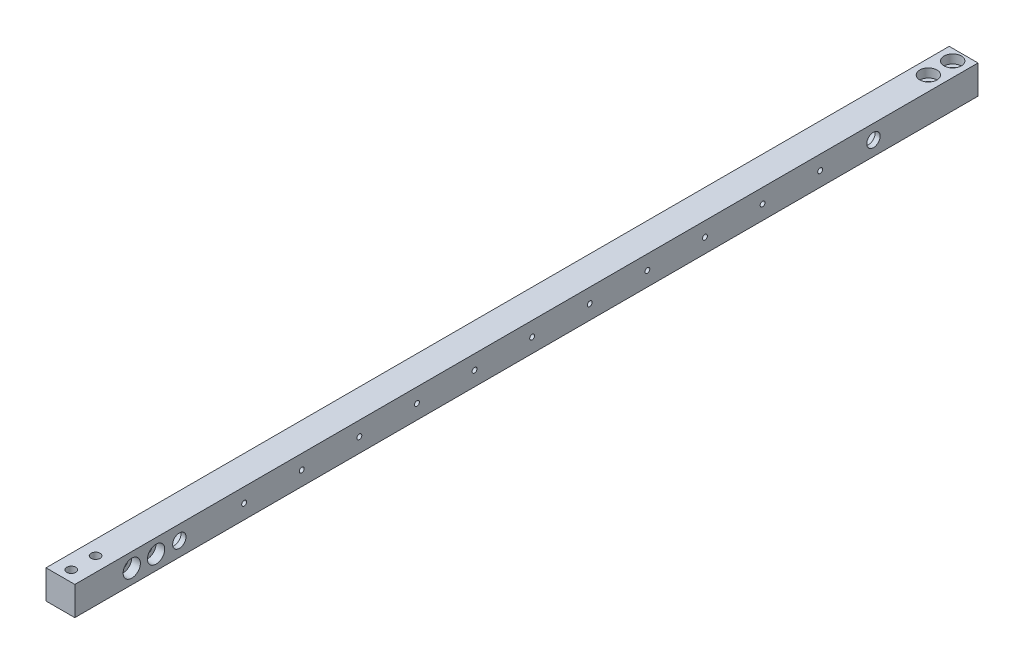
ISO-10303-21;
HEADER;
FILE_DESCRIPTION(('STEP AP214'),'2;1');
FILE_NAME('part.step','',(''),(''),'','','');
FILE_SCHEMA(('AUTOMOTIVE_DESIGN { 1 0 10303 214 1 1 1 1 }'));
ENDSEC;
DATA;
#1=APPLICATION_CONTEXT('core data for automotive mechanical design processes');
#2=APPLICATION_PROTOCOL_DEFINITION('international standard','automotive_design',2000,#1);
#3=PRODUCT_CONTEXT('',#1,'mechanical');
#4=PRODUCT('Part','Part','',(#3));
#5=PRODUCT_RELATED_PRODUCT_CATEGORY('part','',(#4));
#6=PRODUCT_DEFINITION_FORMATION('','',#4);
#7=PRODUCT_DEFINITION_CONTEXT('part definition',#1,'design');
#8=PRODUCT_DEFINITION('design','',#6,#7);
#9=PRODUCT_DEFINITION_SHAPE('','',#8);
#10=(LENGTH_UNIT() NAMED_UNIT(*) SI_UNIT(.MILLI.,.METRE.));
#11=(NAMED_UNIT(*) PLANE_ANGLE_UNIT() SI_UNIT($,.RADIAN.));
#12=(NAMED_UNIT(*) SI_UNIT($,.STERADIAN.) SOLID_ANGLE_UNIT());
#13=UNCERTAINTY_MEASURE_WITH_UNIT(LENGTH_MEASURE(1.E-05),#10,'distance_accuracy_value','');
#14=(GEOMETRIC_REPRESENTATION_CONTEXT(3) GLOBAL_UNCERTAINTY_ASSIGNED_CONTEXT((#13)) GLOBAL_UNIT_ASSIGNED_CONTEXT((#10,
#11,#12)) REPRESENTATION_CONTEXT('',''));
#15=CARTESIAN_POINT('',(0.,0.,0.));
#16=DIRECTION('',(0.,0.,1.));
#17=DIRECTION('',(1.,0.,0.));
#18=AXIS2_PLACEMENT_3D('',#15,#16,#17);
#19=CARTESIAN_POINT('',(0.,0.,497.84));
#20=DIRECTION('',(1.,0.,0.));
#21=DIRECTION('',(0.,1.,0.));
#22=AXIS2_PLACEMENT_3D('',#19,#20,#21);
#23=PLANE('',#22);
#24=CARTESIAN_POINT('',(0.,7.93749999999971,453.040000000001));
#25=DIRECTION('',(1.,0.,0.));
#26=DIRECTION('',(0.,1.,0.));
#27=AXIS2_PLACEMENT_3D('',#24,#25,#26);
#28=CIRCLE('',#27,2.4892);
#29=CARTESIAN_POINT('',(0.,10.4266999999997,453.040000000001));
#30=VERTEX_POINT('',#29);
#31=EDGE_CURVE('E40',#30,#30,#28,.T.);
#32=ORIENTED_EDGE('',*,*,#31,.T.);
#33=EDGE_LOOP('',(#32));
#34=FACE_BOUND('',#33,.T.);
#35=CARTESIAN_POINT('',(0.,7.93749999999971,466.44));
#36=DIRECTION('',(1.,0.,0.));
#37=DIRECTION('',(0.,1.,0.));
#38=AXIS2_PLACEMENT_3D('',#35,#36,#37);
#39=CIRCLE('',#38,2.4892);
#40=CARTESIAN_POINT('',(0.,10.4266999999997,466.44));
#41=VERTEX_POINT('',#40);
#42=EDGE_CURVE('E145',#41,#41,#39,.T.);
#43=ORIENTED_EDGE('',*,*,#42,.T.);
#44=EDGE_LOOP('',(#43));
#45=FACE_BOUND('',#44,.T.);
#46=CARTESIAN_POINT('',(0.,7.93749999999993,404.495));
#47=DIRECTION('',(1.,0.,0.));
#48=DIRECTION('',(0.,1.,0.));
#49=AXIS2_PLACEMENT_3D('',#46,#47,#48);
#50=CIRCLE('',#49,1.35254999999994);
#51=CARTESIAN_POINT('',(0.,9.29004999999987,404.495));
#52=VERTEX_POINT('',#51);
#53=EDGE_CURVE('E191',#52,#52,#50,.T.);
#54=ORIENTED_EDGE('',*,*,#53,.T.);
#55=EDGE_LOOP('',(#54));
#56=FACE_BOUND('',#55,.T.);
#57=CARTESIAN_POINT('',(0.,7.93749999999993,372.745));
#58=DIRECTION('',(1.,0.,0.));
#59=DIRECTION('',(0.,1.,0.));
#60=AXIS2_PLACEMENT_3D('',#57,#58,#59);
#61=CIRCLE('',#60,1.35254999999994);
#62=CARTESIAN_POINT('',(0.,9.29004999999987,372.745));
#63=VERTEX_POINT('',#62);
#64=EDGE_CURVE('E197',#63,#63,#61,.T.);
#65=ORIENTED_EDGE('',*,*,#64,.T.);
#66=EDGE_LOOP('',(#65));
#67=FACE_BOUND('',#66,.T.);
#68=CARTESIAN_POINT('',(0.,7.93749999999993,340.995));
#69=DIRECTION('',(1.,0.,0.));
#70=DIRECTION('',(0.,1.,0.));
#71=AXIS2_PLACEMENT_3D('',#68,#69,#70);
#72=CIRCLE('',#71,1.35254999999994);
#73=CARTESIAN_POINT('',(0.,9.29004999999987,340.995));
#74=VERTEX_POINT('',#73);
#75=EDGE_CURVE('E203',#74,#74,#72,.T.);
#76=ORIENTED_EDGE('',*,*,#75,.T.);
#77=EDGE_LOOP('',(#76));
#78=FACE_BOUND('',#77,.T.);
#79=CARTESIAN_POINT('',(0.,7.93749999999993,309.245));
#80=DIRECTION('',(1.,0.,0.));
#81=DIRECTION('',(0.,1.,0.));
#82=AXIS2_PLACEMENT_3D('',#79,#80,#81);
#83=CIRCLE('',#82,1.35254999999994);
#84=CARTESIAN_POINT('',(0.,9.29004999999987,309.245));
#85=VERTEX_POINT('',#84);
#86=EDGE_CURVE('E209',#85,#85,#83,.T.);
#87=ORIENTED_EDGE('',*,*,#86,.T.);
#88=EDGE_LOOP('',(#87));
#89=FACE_BOUND('',#88,.T.);
#90=CARTESIAN_POINT('',(0.,7.93749999999993,277.495));
#91=DIRECTION('',(1.,0.,0.));
#92=DIRECTION('',(0.,1.,0.));
#93=AXIS2_PLACEMENT_3D('',#90,#91,#92);
#94=CIRCLE('',#93,1.35254999999994);
#95=CARTESIAN_POINT('',(0.,9.29004999999987,277.495));
#96=VERTEX_POINT('',#95);
#97=EDGE_CURVE('E215',#96,#96,#94,.T.);
#98=ORIENTED_EDGE('',*,*,#97,.T.);
#99=EDGE_LOOP('',(#98));
#100=FACE_BOUND('',#99,.T.);
#101=CARTESIAN_POINT('',(0.,7.93749999999993,245.745));
#102=DIRECTION('',(1.,0.,0.));
#103=DIRECTION('',(0.,1.,0.));
#104=AXIS2_PLACEMENT_3D('',#101,#102,#103);
#105=CIRCLE('',#104,1.35254999999994);
#106=CARTESIAN_POINT('',(0.,9.29004999999987,245.745));
#107=VERTEX_POINT('',#106);
#108=EDGE_CURVE('E221',#107,#107,#105,.T.);
#109=ORIENTED_EDGE('',*,*,#108,.T.);
#110=EDGE_LOOP('',(#109));
#111=FACE_BOUND('',#110,.T.);
#112=CARTESIAN_POINT('',(0.,7.93749999999993,213.995));
#113=DIRECTION('',(1.,0.,0.));
#114=DIRECTION('',(0.,1.,0.));
#115=AXIS2_PLACEMENT_3D('',#112,#113,#114);
#116=CIRCLE('',#115,1.35254999999994);
#117=CARTESIAN_POINT('',(0.,9.29004999999987,213.995));
#118=VERTEX_POINT('',#117);
#119=EDGE_CURVE('E227',#118,#118,#116,.T.);
#120=ORIENTED_EDGE('',*,*,#119,.T.);
#121=EDGE_LOOP('',(#120));
#122=FACE_BOUND('',#121,.T.);
#123=CARTESIAN_POINT('',(0.,7.93749999999993,182.245));
#124=DIRECTION('',(1.,0.,0.));
#125=DIRECTION('',(0.,1.,0.));
#126=AXIS2_PLACEMENT_3D('',#123,#124,#125);
#127=CIRCLE('',#126,1.35254999999994);
#128=CARTESIAN_POINT('',(0.,9.29004999999987,182.245));
#129=VERTEX_POINT('',#128);
#130=EDGE_CURVE('E121',#129,#129,#127,.T.);
#131=ORIENTED_EDGE('',*,*,#130,.T.);
#132=EDGE_LOOP('',(#131));
#133=FACE_BOUND('',#132,.T.);
#134=CARTESIAN_POINT('',(0.,7.93749999999993,150.495));
#135=DIRECTION('',(1.,0.,0.));
#136=DIRECTION('',(0.,1.,0.));
#137=AXIS2_PLACEMENT_3D('',#134,#135,#136);
#138=CIRCLE('',#137,1.35254999999994);
#139=CARTESIAN_POINT('',(0.,9.29004999999987,150.495));
#140=VERTEX_POINT('',#139);
#141=EDGE_CURVE('E234',#140,#140,#138,.T.);
#142=ORIENTED_EDGE('',*,*,#141,.T.);
#143=EDGE_LOOP('',(#142));
#144=FACE_BOUND('',#143,.T.);
#145=CARTESIAN_POINT('',(0.,7.93749999999993,118.745));
#146=DIRECTION('',(1.,0.,0.));
#147=DIRECTION('',(0.,1.,0.));
#148=AXIS2_PLACEMENT_3D('',#145,#146,#147);
#149=CIRCLE('',#148,1.35254999999994);
#150=CARTESIAN_POINT('',(0.,9.29004999999987,118.745));
#151=VERTEX_POINT('',#150);
#152=EDGE_CURVE('E240',#151,#151,#149,.T.);
#153=ORIENTED_EDGE('',*,*,#152,.T.);
#154=EDGE_LOOP('',(#153));
#155=FACE_BOUND('',#154,.T.);
#156=CARTESIAN_POINT('',(0.,7.93749999999993,86.9950000000001));
#157=DIRECTION('',(1.,0.,0.));
#158=DIRECTION('',(0.,1.,0.));
#159=AXIS2_PLACEMENT_3D('',#156,#157,#158);
#160=CIRCLE('',#159,1.35254999999994);
#161=CARTESIAN_POINT('',(0.,9.29004999999987,86.9950000000001));
#162=VERTEX_POINT('',#161);
#163=EDGE_CURVE('E246',#162,#162,#160,.T.);
#164=ORIENTED_EDGE('',*,*,#163,.T.);
#165=EDGE_LOOP('',(#164));
#166=FACE_BOUND('',#165,.T.);
#167=CARTESIAN_POINT('',(0.,7.93749999999997,57.6199));
#168=DIRECTION('',(-1.,0.,0.));
#169=DIRECTION('',(0.,1.,0.));
#170=AXIS2_PLACEMENT_3D('',#167,#168,#169);
#171=CIRCLE('',#170,6.81989999999999);
#172=CARTESIAN_POINT('',(0.,14.7574,57.6199));
#173=VERTEX_POINT('',#172);
#174=EDGE_CURVE('E115',#173,#173,#171,.T.);
#175=ORIENTED_EDGE('',*,*,#174,.F.);
#176=EDGE_LOOP('',(#175));
#177=FACE_BOUND('',#176,.T.);
#178=CARTESIAN_POINT('',(0.,7.93749999999999,440.2201));
#179=DIRECTION('',(-1.,0.,0.));
#180=DIRECTION('',(0.,-1.,0.));
#181=AXIS2_PLACEMENT_3D('',#178,#179,#180);
#182=CIRCLE('',#181,6.81989999999997);
#183=CARTESIAN_POINT('',(0.,1.11760000000003,440.2201));
#184=VERTEX_POINT('',#183);
#185=EDGE_CURVE('E256',#184,#184,#182,.T.);
#186=ORIENTED_EDGE('',*,*,#185,.F.);
#187=EDGE_LOOP('',(#186));
#188=FACE_BOUND('',#187,.T.);
#189=DIRECTION('',(0.,-1.,0.));
#190=VECTOR('',#189,1.);
#191=CARTESIAN_POINT('',(0.,0.,0.));
#192=LINE('',#191,#190);
#193=CARTESIAN_POINT('',(0.,15.875,0.));
#194=VERTEX_POINT('',#193);
#195=CARTESIAN_POINT('',(0.,0.,0.));
#196=VERTEX_POINT('',#195);
#197=EDGE_CURVE('E103',#194,#196,#192,.T.);
#198=ORIENTED_EDGE('',*,*,#197,.T.);
#199=DIRECTION('',(0.,0.,-1.));
#200=VECTOR('',#199,1.);
#201=CARTESIAN_POINT('',(0.,0.,497.84));
#202=LINE('',#201,#200);
#203=CARTESIAN_POINT('',(0.,0.,497.84));
#204=VERTEX_POINT('',#203);
#205=EDGE_CURVE('E11',#204,#196,#202,.T.);
#206=ORIENTED_EDGE('',*,*,#205,.F.);
#207=DIRECTION('',(0.,-1.,0.));
#208=VECTOR('',#207,1.);
#209=CARTESIAN_POINT('',(0.,0.,497.84));
#210=LINE('',#209,#208);
#211=CARTESIAN_POINT('',(0.,15.875,497.84));
#212=VERTEX_POINT('',#211);
#213=EDGE_CURVE('E90',#212,#204,#210,.T.);
#214=ORIENTED_EDGE('',*,*,#213,.F.);
#215=DIRECTION('',(0.,0.,-1.));
#216=VECTOR('',#215,1.);
#217=CARTESIAN_POINT('',(0.,15.875,497.84));
#218=LINE('',#217,#216);
#219=EDGE_CURVE('E99',#212,#194,#218,.T.);
#220=ORIENTED_EDGE('',*,*,#219,.T.);
#221=EDGE_LOOP('',(#198,#206,#214,#220));
#222=FACE_BOUND('',#221,.T.);
#223=ADVANCED_FACE('F37',(#34,#45,#56,#67,#78,#89,#100,#111,#122,#133,#144,#155,#166,#177,#188,
#222),#23,.F.);
#224=CARTESIAN_POINT('',(0.,0.,497.84));
#225=DIRECTION('',(0.,1.,0.));
#226=DIRECTION('',(0.,0.,1.));
#227=AXIS2_PLACEMENT_3D('',#224,#225,#226);
#228=PLANE('',#227);
#229=CARTESIAN_POINT('',(7.93750000000043,0.,19.4000000000003));
#230=DIRECTION('',(0.,1.,0.));
#231=DIRECTION('',(0.,0.,1.));
#232=AXIS2_PLACEMENT_3D('',#229,#230,#231);
#233=CIRCLE('',#232,2.4892);
#234=CARTESIAN_POINT('',(7.93750000000043,0.,21.8892000000003));
#235=VERTEX_POINT('',#234);
#236=EDGE_CURVE('E141',#235,#235,#233,.T.);
#237=ORIENTED_EDGE('',*,*,#236,.T.);
#238=EDGE_LOOP('',(#237));
#239=FACE_BOUND('',#238,.T.);
#240=CARTESIAN_POINT('',(7.93750000000043,0.,6.00000000000023));
#241=DIRECTION('',(0.,1.,0.));
#242=DIRECTION('',(0.,0.,1.));
#243=AXIS2_PLACEMENT_3D('',#240,#241,#242);
#244=CIRCLE('',#243,2.4892);
#245=CARTESIAN_POINT('',(7.93750000000043,0.,8.48920000000022));
#246=VERTEX_POINT('',#245);
#247=EDGE_CURVE('E136',#246,#246,#244,.T.);
#248=ORIENTED_EDGE('',*,*,#247,.T.);
#249=EDGE_LOOP('',(#248));
#250=FACE_BOUND('',#249,.T.);
#251=CARTESIAN_POINT('',(7.93750000000015,2.14273828715028E-13,478.44));
#252=DIRECTION('',(0.,-1.,0.));
#253=DIRECTION('',(0.,0.,-1.));
#254=AXIS2_PLACEMENT_3D('',#251,#252,#253);
#255=CIRCLE('',#254,4.7625);
#256=CARTESIAN_POINT('',(7.93750000000015,2.14273828715028E-13,473.6775));
#257=VERTEX_POINT('',#256);
#258=EDGE_CURVE('E139',#257,#257,#255,.T.);
#259=ORIENTED_EDGE('',*,*,#258,.F.);
#260=EDGE_LOOP('',(#259));
#261=FACE_BOUND('',#260,.T.);
#262=CARTESIAN_POINT('',(7.93750000000026,2.20224624127019E-13,491.84));
#263=DIRECTION('',(0.,-1.,0.));
#264=DIRECTION('',(0.,0.,-1.));
#265=AXIS2_PLACEMENT_3D('',#262,#263,#264);
#266=CIRCLE('',#265,4.7625);
#267=CARTESIAN_POINT('',(7.93750000000026,2.20224624127019E-13,487.0775));
#268=VERTEX_POINT('',#267);
#269=EDGE_CURVE('E134',#268,#268,#266,.T.);
#270=ORIENTED_EDGE('',*,*,#269,.F.);
#271=EDGE_LOOP('',(#270));
#272=FACE_BOUND('',#271,.T.);
#273=DIRECTION('',(1.,0.,0.));
#274=VECTOR('',#273,1.);
#275=CARTESIAN_POINT('',(0.,0.,0.));
#276=LINE('',#275,#274);
#277=CARTESIAN_POINT('',(15.875,0.,0.));
#278=VERTEX_POINT('',#277);
#279=EDGE_CURVE('E94',#196,#278,#276,.T.);
#280=ORIENTED_EDGE('',*,*,#279,.T.);
#281=DIRECTION('',(0.,0.,-1.));
#282=VECTOR('',#281,1.);
#283=CARTESIAN_POINT('',(15.875,0.,497.84));
#284=LINE('',#283,#282);
#285=CARTESIAN_POINT('',(15.875,0.,497.84));
#286=VERTEX_POINT('',#285);
#287=EDGE_CURVE('E46',#286,#278,#284,.T.);
#288=ORIENTED_EDGE('',*,*,#287,.F.);
#289=DIRECTION('',(1.,0.,0.));
#290=VECTOR('',#289,1.);
#291=CARTESIAN_POINT('',(0.,0.,497.84));
#292=LINE('',#291,#290);
#293=EDGE_CURVE('E85',#204,#286,#292,.T.);
#294=ORIENTED_EDGE('',*,*,#293,.F.);
#295=ORIENTED_EDGE('',*,*,#205,.T.);
#296=EDGE_LOOP('',(#280,#288,#294,#295));
#297=FACE_BOUND('',#296,.T.);
#298=ADVANCED_FACE('F93',(#239,#250,#261,#272,#297),#228,.F.);
#299=CARTESIAN_POINT('',(15.875,0.,497.84));
#300=DIRECTION('',(-1.,0.,0.));
#301=DIRECTION('',(0.,-1.,0.));
#302=AXIS2_PLACEMENT_3D('',#299,#300,#301);
#303=PLANE('',#302);
#304=CARTESIAN_POINT('',(15.875,7.93749999999971,453.040000000001));
#305=DIRECTION('',(1.,0.,0.));
#306=DIRECTION('',(0.,0.,-1.));
#307=AXIS2_PLACEMENT_3D('',#304,#305,#306);
#308=CIRCLE('',#307,4.7625);
#309=CARTESIAN_POINT('',(15.875,7.93749999999971,448.277500000001));
#310=VERTEX_POINT('',#309);
#311=EDGE_CURVE('E643',#310,#310,#308,.T.);
#312=ORIENTED_EDGE('',*,*,#311,.F.);
#313=EDGE_LOOP('',(#312));
#314=FACE_BOUND('',#313,.T.);
#315=CARTESIAN_POINT('',(15.875,7.93749999999971,466.44));
#316=DIRECTION('',(1.,0.,0.));
#317=DIRECTION('',(0.,0.,-1.));
#318=AXIS2_PLACEMENT_3D('',#315,#316,#317);
#319=CIRCLE('',#318,4.7625);
#320=CARTESIAN_POINT('',(15.875,7.93749999999971,461.6775));
#321=VERTEX_POINT('',#320);
#322=EDGE_CURVE('E160',#321,#321,#319,.T.);
#323=ORIENTED_EDGE('',*,*,#322,.F.);
#324=EDGE_LOOP('',(#323));
#325=FACE_BOUND('',#324,.T.);
#326=CARTESIAN_POINT('',(15.8750000000001,7.93749999999993,404.495));
#327=DIRECTION('',(-1.,0.,0.));
#328=DIRECTION('',(0.,0.,1.));
#329=AXIS2_PLACEMENT_3D('',#326,#327,#328);
#330=CIRCLE('',#329,1.35254999999988);
#331=CARTESIAN_POINT('',(15.8750000000001,7.93749999999993,405.84755));
#332=VERTEX_POINT('',#331);
#333=EDGE_CURVE('E129',#332,#332,#330,.T.);
#334=ORIENTED_EDGE('',*,*,#333,.T.);
#335=EDGE_LOOP('',(#334));
#336=FACE_BOUND('',#335,.T.);
#337=CARTESIAN_POINT('',(15.8750000000001,7.93749999999993,372.745));
#338=DIRECTION('',(-1.,0.,0.));
#339=DIRECTION('',(0.,0.,1.));
#340=AXIS2_PLACEMENT_3D('',#337,#338,#339);
#341=CIRCLE('',#340,1.35254999999988);
#342=CARTESIAN_POINT('',(15.8750000000001,7.93749999999993,374.09755));
#343=VERTEX_POINT('',#342);
#344=EDGE_CURVE('E194',#343,#343,#341,.T.);
#345=ORIENTED_EDGE('',*,*,#344,.T.);
#346=EDGE_LOOP('',(#345));
#347=FACE_BOUND('',#346,.T.);
#348=CARTESIAN_POINT('',(15.875,7.93749999999993,340.995));
#349=DIRECTION('',(-1.,0.,0.));
#350=DIRECTION('',(0.,0.,1.));
#351=AXIS2_PLACEMENT_3D('',#348,#349,#350);
#352=CIRCLE('',#351,1.35254999999988);
#353=CARTESIAN_POINT('',(15.875,7.93749999999993,342.34755));
#354=VERTEX_POINT('',#353);
#355=EDGE_CURVE('E200',#354,#354,#352,.T.);
#356=ORIENTED_EDGE('',*,*,#355,.T.);
#357=EDGE_LOOP('',(#356));
#358=FACE_BOUND('',#357,.T.);
#359=CARTESIAN_POINT('',(15.875,7.93749999999993,309.245));
#360=DIRECTION('',(-1.,0.,0.));
#361=DIRECTION('',(0.,0.,1.));
#362=AXIS2_PLACEMENT_3D('',#359,#360,#361);
#363=CIRCLE('',#362,1.35254999999988);
#364=CARTESIAN_POINT('',(15.875,7.93749999999993,310.59755));
#365=VERTEX_POINT('',#364);
#366=EDGE_CURVE('E206',#365,#365,#363,.T.);
#367=ORIENTED_EDGE('',*,*,#366,.T.);
#368=EDGE_LOOP('',(#367));
#369=FACE_BOUND('',#368,.T.);
#370=CARTESIAN_POINT('',(15.875,7.93749999999993,277.495));
#371=DIRECTION('',(-1.,0.,0.));
#372=DIRECTION('',(0.,0.,1.));
#373=AXIS2_PLACEMENT_3D('',#370,#371,#372);
#374=CIRCLE('',#373,1.35254999999988);
#375=CARTESIAN_POINT('',(15.875,7.93749999999993,278.84755));
#376=VERTEX_POINT('',#375);
#377=EDGE_CURVE('E212',#376,#376,#374,.T.);
#378=ORIENTED_EDGE('',*,*,#377,.T.);
#379=EDGE_LOOP('',(#378));
#380=FACE_BOUND('',#379,.T.);
#381=CARTESIAN_POINT('',(15.875,7.93749999999993,245.745));
#382=DIRECTION('',(-1.,0.,0.));
#383=DIRECTION('',(0.,0.,1.));
#384=AXIS2_PLACEMENT_3D('',#381,#382,#383);
#385=CIRCLE('',#384,1.35254999999988);
#386=CARTESIAN_POINT('',(15.875,7.93749999999993,247.09755));
#387=VERTEX_POINT('',#386);
#388=EDGE_CURVE('E218',#387,#387,#385,.T.);
#389=ORIENTED_EDGE('',*,*,#388,.T.);
#390=EDGE_LOOP('',(#389));
#391=FACE_BOUND('',#390,.T.);
#392=CARTESIAN_POINT('',(15.875,7.93749999999993,213.995));
#393=DIRECTION('',(-1.,0.,0.));
#394=DIRECTION('',(0.,0.,1.));
#395=AXIS2_PLACEMENT_3D('',#392,#393,#394);
#396=CIRCLE('',#395,1.35254999999988);
#397=CARTESIAN_POINT('',(15.875,7.93749999999993,215.34755));
#398=VERTEX_POINT('',#397);
#399=EDGE_CURVE('E224',#398,#398,#396,.T.);
#400=ORIENTED_EDGE('',*,*,#399,.T.);
#401=EDGE_LOOP('',(#400));
#402=FACE_BOUND('',#401,.T.);
#403=CARTESIAN_POINT('',(15.875,7.93749999999993,182.245));
#404=DIRECTION('',(-1.,0.,0.));
#405=DIRECTION('',(0.,0.,1.));
#406=AXIS2_PLACEMENT_3D('',#403,#404,#405);
#407=CIRCLE('',#406,1.35254999999988);
#408=CARTESIAN_POINT('',(15.875,7.93749999999993,183.59755));
#409=VERTEX_POINT('',#408);
#410=EDGE_CURVE('E125',#409,#409,#407,.T.);
#411=ORIENTED_EDGE('',*,*,#410,.T.);
#412=EDGE_LOOP('',(#411));
#413=FACE_BOUND('',#412,.T.);
#414=CARTESIAN_POINT('',(15.875,7.93749999999993,150.495));
#415=DIRECTION('',(-1.,0.,0.));
#416=DIRECTION('',(0.,0.,1.));
#417=AXIS2_PLACEMENT_3D('',#414,#415,#416);
#418=CIRCLE('',#417,1.35254999999988);
#419=CARTESIAN_POINT('',(15.875,7.93749999999993,151.84755));
#420=VERTEX_POINT('',#419);
#421=EDGE_CURVE('E124',#420,#420,#418,.T.);
#422=ORIENTED_EDGE('',*,*,#421,.T.);
#423=EDGE_LOOP('',(#422));
#424=FACE_BOUND('',#423,.T.);
#425=CARTESIAN_POINT('',(15.875,7.93749999999993,118.745));
#426=DIRECTION('',(-1.,0.,0.));
#427=DIRECTION('',(0.,0.,1.));
#428=AXIS2_PLACEMENT_3D('',#425,#426,#427);
#429=CIRCLE('',#428,1.35254999999988);
#430=CARTESIAN_POINT('',(15.875,7.93749999999993,120.09755));
#431=VERTEX_POINT('',#430);
#432=EDGE_CURVE('E237',#431,#431,#429,.T.);
#433=ORIENTED_EDGE('',*,*,#432,.T.);
#434=EDGE_LOOP('',(#433));
#435=FACE_BOUND('',#434,.T.);
#436=CARTESIAN_POINT('',(15.875,7.93749999999993,86.9950000000001));
#437=DIRECTION('',(-1.,0.,0.));
#438=DIRECTION('',(0.,0.,1.));
#439=AXIS2_PLACEMENT_3D('',#436,#437,#438);
#440=CIRCLE('',#439,1.35254999999988);
#441=CARTESIAN_POINT('',(15.875,7.93749999999993,88.34755));
#442=VERTEX_POINT('',#441);
#443=EDGE_CURVE('E243',#442,#442,#440,.T.);
#444=ORIENTED_EDGE('',*,*,#443,.T.);
#445=EDGE_LOOP('',(#444));
#446=FACE_BOUND('',#445,.T.);
#447=CARTESIAN_POINT('',(15.875,7.93749999999997,57.6199));
#448=DIRECTION('',(-1.,0.,0.));
#449=DIRECTION('',(0.,-1.,0.));
#450=AXIS2_PLACEMENT_3D('',#447,#448,#449);
#451=CIRCLE('',#450,3.68299999999999);
#452=CARTESIAN_POINT('',(15.875,4.25449999999998,57.6199));
#453=VERTEX_POINT('',#452);
#454=EDGE_CURVE('E117',#453,#453,#451,.T.);
#455=ORIENTED_EDGE('',*,*,#454,.T.);
#456=EDGE_LOOP('',(#455));
#457=FACE_BOUND('',#456,.T.);
#458=CARTESIAN_POINT('',(15.875,7.93749999999999,440.2201));
#459=DIRECTION('',(-1.,0.,0.));
#460=DIRECTION('',(0.,-1.,0.));
#461=AXIS2_PLACEMENT_3D('',#458,#459,#460);
#462=CIRCLE('',#461,3.68299999999999);
#463=CARTESIAN_POINT('',(15.875,4.2545,440.2201));
#464=VERTEX_POINT('',#463);
#465=EDGE_CURVE('E112',#464,#464,#462,.T.);
#466=ORIENTED_EDGE('',*,*,#465,.T.);
#467=EDGE_LOOP('',(#466));
#468=FACE_BOUND('',#467,.T.);
#469=DIRECTION('',(0.,1.,0.));
#470=VECTOR('',#469,1.);
#471=CARTESIAN_POINT('',(15.875,0.,0.));
#472=LINE('',#471,#470);
#473=CARTESIAN_POINT('',(15.875,15.875,0.));
#474=VERTEX_POINT('',#473);
#475=EDGE_CURVE('E72',#278,#474,#472,.T.);
#476=ORIENTED_EDGE('',*,*,#475,.T.);
#477=DIRECTION('',(0.,0.,-1.));
#478=VECTOR('',#477,1.);
#479=CARTESIAN_POINT('',(15.875,15.875,497.84));
#480=LINE('',#479,#478);
#481=CARTESIAN_POINT('',(15.875,15.875,497.84));
#482=VERTEX_POINT('',#481);
#483=EDGE_CURVE('E95',#482,#474,#480,.T.);
#484=ORIENTED_EDGE('',*,*,#483,.F.);
#485=DIRECTION('',(0.,1.,0.));
#486=VECTOR('',#485,1.);
#487=CARTESIAN_POINT('',(15.875,0.,497.84));
#488=LINE('',#487,#486);
#489=EDGE_CURVE('E88',#286,#482,#488,.T.);
#490=ORIENTED_EDGE('',*,*,#489,.F.);
#491=ORIENTED_EDGE('',*,*,#287,.T.);
#492=EDGE_LOOP('',(#476,#484,#490,#491));
#493=FACE_BOUND('',#492,.T.);
#494=ADVANCED_FACE('F97',(#314,#325,#336,#347,#358,#369,#380,#391,#402,#413,#424,#435,#446,#457,
#468,#493),#303,.F.);
#495=CARTESIAN_POINT('',(0.,15.875,497.84));
#496=DIRECTION('',(0.,-1.,0.));
#497=DIRECTION('',(0.,0.,-1.));
#498=AXIS2_PLACEMENT_3D('',#495,#496,#497);
#499=PLANE('',#498);
#500=CARTESIAN_POINT('',(7.93750000000043,15.8750000000001,19.4000000000003));
#501=DIRECTION('',(0.,1.,0.));
#502=DIRECTION('',(0.,0.,1.));
#503=AXIS2_PLACEMENT_3D('',#500,#501,#502);
#504=CIRCLE('',#503,4.7625);
#505=CARTESIAN_POINT('',(7.93750000000043,15.8750000000001,24.1625000000003));
#506=VERTEX_POINT('',#505);
#507=EDGE_CURVE('E147',#506,#506,#504,.T.);
#508=ORIENTED_EDGE('',*,*,#507,.F.);
#509=EDGE_LOOP('',(#508));
#510=FACE_BOUND('',#509,.T.);
#511=CARTESIAN_POINT('',(7.93750000000043,15.8750000000001,6.00000000000023));
#512=DIRECTION('',(0.,1.,0.));
#513=DIRECTION('',(0.,0.,1.));
#514=AXIS2_PLACEMENT_3D('',#511,#512,#513);
#515=CIRCLE('',#514,4.7625);
#516=CARTESIAN_POINT('',(7.93750000000043,15.8750000000001,10.7625000000002));
#517=VERTEX_POINT('',#516);
#518=EDGE_CURVE('E143',#517,#517,#515,.T.);
#519=ORIENTED_EDGE('',*,*,#518,.F.);
#520=EDGE_LOOP('',(#519));
#521=FACE_BOUND('',#520,.T.);
#522=CARTESIAN_POINT('',(7.93750000000015,15.875,478.44));
#523=DIRECTION('',(0.,-1.,0.));
#524=DIRECTION('',(0.,0.,-1.));
#525=AXIS2_PLACEMENT_3D('',#522,#523,#524);
#526=CIRCLE('',#525,2.4892);
#527=CARTESIAN_POINT('',(7.93750000000015,15.875,475.9508));
#528=VERTEX_POINT('',#527);
#529=EDGE_CURVE('E131',#528,#528,#526,.T.);
#530=ORIENTED_EDGE('',*,*,#529,.T.);
#531=EDGE_LOOP('',(#530));
#532=FACE_BOUND('',#531,.T.);
#533=CARTESIAN_POINT('',(7.93750000000026,15.875,491.84));
#534=DIRECTION('',(0.,-1.,0.));
#535=DIRECTION('',(0.,0.,-1.));
#536=AXIS2_PLACEMENT_3D('',#533,#534,#535);
#537=CIRCLE('',#536,2.4892);
#538=CARTESIAN_POINT('',(7.93750000000026,15.875,489.350800000001));
#539=VERTEX_POINT('',#538);
#540=EDGE_CURVE('E126',#539,#539,#537,.T.);
#541=ORIENTED_EDGE('',*,*,#540,.T.);
#542=EDGE_LOOP('',(#541));
#543=FACE_BOUND('',#542,.T.);
#544=DIRECTION('',(-1.,0.,0.));
#545=VECTOR('',#544,1.);
#546=CARTESIAN_POINT('',(0.,15.875,0.));
#547=LINE('',#546,#545);
#548=EDGE_CURVE('E78',#474,#194,#547,.T.);
#549=ORIENTED_EDGE('',*,*,#548,.T.);
#550=ORIENTED_EDGE('',*,*,#219,.F.);
#551=DIRECTION('',(-1.,0.,0.));
#552=VECTOR('',#551,1.);
#553=CARTESIAN_POINT('',(0.,15.875,497.84));
#554=LINE('',#553,#552);
#555=EDGE_CURVE('E55',#482,#212,#554,.T.);
#556=ORIENTED_EDGE('',*,*,#555,.F.);
#557=ORIENTED_EDGE('',*,*,#483,.T.);
#558=EDGE_LOOP('',(#549,#550,#556,#557));
#559=FACE_BOUND('',#558,.T.);
#560=ADVANCED_FACE('F281',(#510,#521,#532,#543,#559),#499,.F.);
#561=CARTESIAN_POINT('',(0.,0.,497.84));
#562=DIRECTION('',(0.,0.,-1.));
#563=DIRECTION('',(-1.,0.,0.));
#564=AXIS2_PLACEMENT_3D('',#561,#562,#563);
#565=PLANE('',#564);
#566=ORIENTED_EDGE('',*,*,#213,.T.);
#567=ORIENTED_EDGE('',*,*,#293,.T.);
#568=ORIENTED_EDGE('',*,*,#489,.T.);
#569=ORIENTED_EDGE('',*,*,#555,.T.);
#570=EDGE_LOOP('',(#566,#567,#568,#569));
#571=FACE_BOUND('',#570,.T.);
#572=ADVANCED_FACE('F86',(#571),#565,.F.);
#573=CARTESIAN_POINT('',(0.,0.,0.));
#574=DIRECTION('',(0.,0.,-1.));
#575=DIRECTION('',(-1.,0.,0.));
#576=AXIS2_PLACEMENT_3D('',#573,#574,#575);
#577=PLANE('',#576);
#578=ORIENTED_EDGE('',*,*,#197,.F.);
#579=ORIENTED_EDGE('',*,*,#548,.F.);
#580=ORIENTED_EDGE('',*,*,#475,.F.);
#581=ORIENTED_EDGE('',*,*,#279,.F.);
#582=EDGE_LOOP('',(#578,#579,#580,#581));
#583=FACE_BOUND('',#582,.T.);
#584=ADVANCED_FACE('F271',(#583),#577,.T.);
#585=CARTESIAN_POINT('',(13.08608,7.93749999999999,440.2201));
#586=DIRECTION('',(-1.,0.,0.));
#587=DIRECTION('',(0.,-1.,0.));
#588=AXIS2_PLACEMENT_3D('',#585,#586,#587);
#589=CYLINDRICAL_SURFACE('',#588,6.81989999999997);
#590=CARTESIAN_POINT('',(13.08608,7.93749999999999,440.2201));
#591=DIRECTION('',(-1.,0.,0.));
#592=DIRECTION('',(0.,-1.,0.));
#593=AXIS2_PLACEMENT_3D('',#590,#591,#592);
#594=CIRCLE('',#593,6.81989999999997);
#595=CARTESIAN_POINT('',(13.08608,1.11760000000003,440.2201));
#596=VERTEX_POINT('',#595);
#597=EDGE_CURVE('E106',#596,#596,#594,.T.);
#598=ORIENTED_EDGE('',*,*,#597,.F.);
#599=EDGE_LOOP('',(#598));
#600=FACE_BOUND('',#599,.T.);
#601=ORIENTED_EDGE('',*,*,#185,.T.);
#602=EDGE_LOOP('',(#601));
#603=FACE_BOUND('',#602,.T.);
#604=ADVANCED_FACE('F264',(#600,#603),#589,.F.);
#605=CARTESIAN_POINT('',(13.08608,7.93749999999999,440.2201));
#606=DIRECTION('',(-1.,0.,0.));
#607=DIRECTION('',(0.,-1.,0.));
#608=AXIS2_PLACEMENT_3D('',#605,#606,#607);
#609=PLANE('',#608);
#610=CARTESIAN_POINT('',(13.08608,7.93749999999999,440.2201));
#611=DIRECTION('',(-1.,0.,0.));
#612=DIRECTION('',(0.,0.,1.));
#613=AXIS2_PLACEMENT_3D('',#610,#611,#612);
#614=CIRCLE('',#613,3.68299999999999);
#615=CARTESIAN_POINT('',(13.08608,7.93749999999999,443.9031));
#616=VERTEX_POINT('',#615);
#617=EDGE_CURVE('E116',#616,#616,#614,.T.);
#618=ORIENTED_EDGE('',*,*,#617,.F.);
#619=EDGE_LOOP('',(#618));
#620=FACE_BOUND('',#619,.T.);
#621=ORIENTED_EDGE('',*,*,#597,.T.);
#622=EDGE_LOOP('',(#621));
#623=FACE_BOUND('',#622,.T.);
#624=ADVANCED_FACE('F278',(#620,#623),#609,.T.);
#625=CARTESIAN_POINT('',(13.08608,7.93749999999997,57.6199));
#626=DIRECTION('',(-1.,0.,0.));
#627=DIRECTION('',(0.,-1.,0.));
#628=AXIS2_PLACEMENT_3D('',#625,#626,#627);
#629=CYLINDRICAL_SURFACE('',#628,6.81989999999999);
#630=CARTESIAN_POINT('',(13.08608,7.93749999999997,57.6199));
#631=DIRECTION('',(-1.,0.,0.));
#632=DIRECTION('',(0.,1.,0.));
#633=AXIS2_PLACEMENT_3D('',#630,#631,#632);
#634=CIRCLE('',#633,6.81989999999999);
#635=CARTESIAN_POINT('',(13.08608,14.7574,57.6199));
#636=VERTEX_POINT('',#635);
#637=EDGE_CURVE('E253',#636,#636,#634,.T.);
#638=ORIENTED_EDGE('',*,*,#637,.F.);
#639=EDGE_LOOP('',(#638));
#640=FACE_BOUND('',#639,.T.);
#641=ORIENTED_EDGE('',*,*,#174,.T.);
#642=EDGE_LOOP('',(#641));
#643=FACE_BOUND('',#642,.T.);
#644=ADVANCED_FACE('F378',(#640,#643),#629,.F.);
#645=CARTESIAN_POINT('',(13.08608,7.93749999999997,57.6199));
#646=DIRECTION('',(1.,0.,0.));
#647=DIRECTION('',(0.,1.,0.));
#648=AXIS2_PLACEMENT_3D('',#645,#646,#647);
#649=PLANE('',#648);
#650=CARTESIAN_POINT('',(13.08608,7.93749999999997,57.6199));
#651=DIRECTION('',(-1.,0.,0.));
#652=DIRECTION('',(0.,0.,1.));
#653=AXIS2_PLACEMENT_3D('',#650,#651,#652);
#654=CIRCLE('',#653,3.68299999999999);
#655=CARTESIAN_POINT('',(13.08608,7.93749999999997,61.3029));
#656=VERTEX_POINT('',#655);
#657=EDGE_CURVE('E120',#656,#656,#654,.T.);
#658=ORIENTED_EDGE('',*,*,#657,.F.);
#659=EDGE_LOOP('',(#658));
#660=FACE_BOUND('',#659,.T.);
#661=ORIENTED_EDGE('',*,*,#637,.T.);
#662=EDGE_LOOP('',(#661));
#663=FACE_BOUND('',#662,.T.);
#664=ADVANCED_FACE('F374',(#660,#663),#649,.F.);
#665=CARTESIAN_POINT('',(13.08608,7.93749999999999,440.2201));
#666=DIRECTION('',(-1.,0.,0.));
#667=DIRECTION('',(0.,0.,1.));
#668=AXIS2_PLACEMENT_3D('',#665,#666,#667);
#669=CYLINDRICAL_SURFACE('',#668,3.68299999999999);
#670=ORIENTED_EDGE('',*,*,#617,.T.);
#671=EDGE_LOOP('',(#670));
#672=FACE_BOUND('',#671,.T.);
#673=ORIENTED_EDGE('',*,*,#465,.F.);
#674=EDGE_LOOP('',(#673));
#675=FACE_BOUND('',#674,.T.);
#676=ADVANCED_FACE('F370',(#672,#675),#669,.F.);
#677=CARTESIAN_POINT('',(13.08608,7.93749999999997,57.6199));
#678=DIRECTION('',(-1.,0.,0.));
#679=DIRECTION('',(0.,0.,1.));
#680=AXIS2_PLACEMENT_3D('',#677,#678,#679);
#681=CYLINDRICAL_SURFACE('',#680,3.68299999999999);
#682=ORIENTED_EDGE('',*,*,#657,.T.);
#683=EDGE_LOOP('',(#682));
#684=FACE_BOUND('',#683,.T.);
#685=ORIENTED_EDGE('',*,*,#454,.F.);
#686=EDGE_LOOP('',(#685));
#687=FACE_BOUND('',#686,.T.);
#688=ADVANCED_FACE('F366',(#684,#687),#681,.F.);
#689=CARTESIAN_POINT('',(-468.3125,7.93749999999993,86.9950000000002));
#690=DIRECTION('',(-1.,0.,0.));
#691=DIRECTION('',(0.,0.,1.));
#692=AXIS2_PLACEMENT_3D('',#689,#690,#691);
#693=CYLINDRICAL_SURFACE('',#692,1.35254999999994);
#694=ORIENTED_EDGE('',*,*,#443,.F.);
#695=EDGE_LOOP('',(#694));
#696=FACE_BOUND('',#695,.T.);
#697=ORIENTED_EDGE('',*,*,#163,.F.);
#698=EDGE_LOOP('',(#697));
#699=FACE_BOUND('',#698,.T.);
#700=ADVANCED_FACE('F362',(#696,#699),#693,.F.);
#701=CARTESIAN_POINT('',(-468.3125,7.93749999999993,118.745));
#702=DIRECTION('',(-1.,0.,0.));
#703=DIRECTION('',(0.,0.,1.));
#704=AXIS2_PLACEMENT_3D('',#701,#702,#703);
#705=CYLINDRICAL_SURFACE('',#704,1.35254999999994);
#706=ORIENTED_EDGE('',*,*,#432,.F.);
#707=EDGE_LOOP('',(#706));
#708=FACE_BOUND('',#707,.T.);
#709=ORIENTED_EDGE('',*,*,#152,.F.);
#710=EDGE_LOOP('',(#709));
#711=FACE_BOUND('',#710,.T.);
#712=ADVANCED_FACE('F358',(#708,#711),#705,.F.);
#713=CARTESIAN_POINT('',(-468.3125,7.93749999999993,150.495));
#714=DIRECTION('',(-1.,0.,0.));
#715=DIRECTION('',(0.,0.,1.));
#716=AXIS2_PLACEMENT_3D('',#713,#714,#715);
#717=CYLINDRICAL_SURFACE('',#716,1.35254999999994);
#718=ORIENTED_EDGE('',*,*,#421,.F.);
#719=EDGE_LOOP('',(#718));
#720=FACE_BOUND('',#719,.T.);
#721=ORIENTED_EDGE('',*,*,#141,.F.);
#722=EDGE_LOOP('',(#721));
#723=FACE_BOUND('',#722,.T.);
#724=ADVANCED_FACE('F354',(#720,#723),#717,.F.);
#725=CARTESIAN_POINT('',(-468.3125,7.93749999999993,182.245));
#726=DIRECTION('',(-1.,0.,0.));
#727=DIRECTION('',(0.,0.,1.));
#728=AXIS2_PLACEMENT_3D('',#725,#726,#727);
#729=CYLINDRICAL_SURFACE('',#728,1.35254999999994);
#730=ORIENTED_EDGE('',*,*,#410,.F.);
#731=EDGE_LOOP('',(#730));
#732=FACE_BOUND('',#731,.T.);
#733=ORIENTED_EDGE('',*,*,#130,.F.);
#734=EDGE_LOOP('',(#733));
#735=FACE_BOUND('',#734,.T.);
#736=ADVANCED_FACE('F350',(#732,#735),#729,.F.);
#737=CARTESIAN_POINT('',(-468.3125,7.93749999999993,213.995));
#738=DIRECTION('',(-1.,0.,0.));
#739=DIRECTION('',(0.,0.,1.));
#740=AXIS2_PLACEMENT_3D('',#737,#738,#739);
#741=CYLINDRICAL_SURFACE('',#740,1.35254999999994);
#742=ORIENTED_EDGE('',*,*,#399,.F.);
#743=EDGE_LOOP('',(#742));
#744=FACE_BOUND('',#743,.T.);
#745=ORIENTED_EDGE('',*,*,#119,.F.);
#746=EDGE_LOOP('',(#745));
#747=FACE_BOUND('',#746,.T.);
#748=ADVANCED_FACE('F346',(#744,#747),#741,.F.);
#749=CARTESIAN_POINT('',(-468.3125,7.93749999999993,245.745));
#750=DIRECTION('',(-1.,0.,0.));
#751=DIRECTION('',(0.,0.,1.));
#752=AXIS2_PLACEMENT_3D('',#749,#750,#751);
#753=CYLINDRICAL_SURFACE('',#752,1.35254999999994);
#754=ORIENTED_EDGE('',*,*,#388,.F.);
#755=EDGE_LOOP('',(#754));
#756=FACE_BOUND('',#755,.T.);
#757=ORIENTED_EDGE('',*,*,#108,.F.);
#758=EDGE_LOOP('',(#757));
#759=FACE_BOUND('',#758,.T.);
#760=ADVANCED_FACE('F342',(#756,#759),#753,.F.);
#761=CARTESIAN_POINT('',(-468.3125,7.93749999999993,277.495));
#762=DIRECTION('',(-1.,0.,0.));
#763=DIRECTION('',(0.,0.,1.));
#764=AXIS2_PLACEMENT_3D('',#761,#762,#763);
#765=CYLINDRICAL_SURFACE('',#764,1.35254999999994);
#766=ORIENTED_EDGE('',*,*,#377,.F.);
#767=EDGE_LOOP('',(#766));
#768=FACE_BOUND('',#767,.T.);
#769=ORIENTED_EDGE('',*,*,#97,.F.);
#770=EDGE_LOOP('',(#769));
#771=FACE_BOUND('',#770,.T.);
#772=ADVANCED_FACE('F338',(#768,#771),#765,.F.);
#773=CARTESIAN_POINT('',(-468.3125,7.93749999999993,309.245));
#774=DIRECTION('',(-1.,0.,0.));
#775=DIRECTION('',(0.,0.,1.));
#776=AXIS2_PLACEMENT_3D('',#773,#774,#775);
#777=CYLINDRICAL_SURFACE('',#776,1.35254999999994);
#778=ORIENTED_EDGE('',*,*,#366,.F.);
#779=EDGE_LOOP('',(#778));
#780=FACE_BOUND('',#779,.T.);
#781=ORIENTED_EDGE('',*,*,#86,.F.);
#782=EDGE_LOOP('',(#781));
#783=FACE_BOUND('',#782,.T.);
#784=ADVANCED_FACE('F334',(#780,#783),#777,.F.);
#785=CARTESIAN_POINT('',(-468.3125,7.93749999999993,340.995));
#786=DIRECTION('',(-1.,0.,0.));
#787=DIRECTION('',(0.,0.,1.));
#788=AXIS2_PLACEMENT_3D('',#785,#786,#787);
#789=CYLINDRICAL_SURFACE('',#788,1.35254999999994);
#790=ORIENTED_EDGE('',*,*,#355,.F.);
#791=EDGE_LOOP('',(#790));
#792=FACE_BOUND('',#791,.T.);
#793=ORIENTED_EDGE('',*,*,#75,.F.);
#794=EDGE_LOOP('',(#793));
#795=FACE_BOUND('',#794,.T.);
#796=ADVANCED_FACE('F330',(#792,#795),#789,.F.);
#797=CARTESIAN_POINT('',(-468.3125,7.93749999999993,372.745));
#798=DIRECTION('',(-1.,0.,0.));
#799=DIRECTION('',(0.,0.,1.));
#800=AXIS2_PLACEMENT_3D('',#797,#798,#799);
#801=CYLINDRICAL_SURFACE('',#800,1.35254999999994);
#802=ORIENTED_EDGE('',*,*,#344,.F.);
#803=EDGE_LOOP('',(#802));
#804=FACE_BOUND('',#803,.T.);
#805=ORIENTED_EDGE('',*,*,#64,.F.);
#806=EDGE_LOOP('',(#805));
#807=FACE_BOUND('',#806,.T.);
#808=ADVANCED_FACE('F326',(#804,#807),#801,.F.);
#809=CARTESIAN_POINT('',(-468.3125,7.93749999999993,404.495));
#810=DIRECTION('',(-1.,0.,0.));
#811=DIRECTION('',(0.,0.,1.));
#812=AXIS2_PLACEMENT_3D('',#809,#810,#811);
#813=CYLINDRICAL_SURFACE('',#812,1.35254999999994);
#814=ORIENTED_EDGE('',*,*,#333,.F.);
#815=EDGE_LOOP('',(#814));
#816=FACE_BOUND('',#815,.T.);
#817=ORIENTED_EDGE('',*,*,#53,.F.);
#818=EDGE_LOOP('',(#817));
#819=FACE_BOUND('',#818,.T.);
#820=ADVANCED_FACE('F322',(#816,#819),#813,.F.);
#821=CARTESIAN_POINT('',(7.93750000000026,2.20224624127019E-13,491.84));
#822=DIRECTION('',(0.,-1.,0.));
#823=DIRECTION('',(0.,0.,-1.));
#824=AXIS2_PLACEMENT_3D('',#821,#822,#823);
#825=CYLINDRICAL_SURFACE('',#824,2.4892);
#826=CARTESIAN_POINT('',(7.93750000000026,4.82600000000022,491.84));
#827=DIRECTION('',(0.,-1.,0.));
#828=DIRECTION('',(0.,0.,-1.));
#829=AXIS2_PLACEMENT_3D('',#826,#827,#828);
#830=CIRCLE('',#829,2.4892);
#831=CARTESIAN_POINT('',(7.93750000000026,4.82600000000022,489.350800000001));
#832=VERTEX_POINT('',#831);
#833=EDGE_CURVE('E130',#832,#832,#830,.T.);
#834=ORIENTED_EDGE('',*,*,#833,.T.);
#835=EDGE_LOOP('',(#834));
#836=FACE_BOUND('',#835,.T.);
#837=ORIENTED_EDGE('',*,*,#540,.F.);
#838=EDGE_LOOP('',(#837));
#839=FACE_BOUND('',#838,.T.);
#840=ADVANCED_FACE('F314',(#836,#839),#825,.F.);
#841=CARTESIAN_POINT('',(10.4267000000003,4.82600000000022,491.84));
#842=DIRECTION('',(0.,1.,0.));
#843=DIRECTION('',(0.,0.,1.));
#844=AXIS2_PLACEMENT_3D('',#841,#842,#843);
#845=PLANE('',#844);
#846=ORIENTED_EDGE('',*,*,#833,.F.);
#847=EDGE_LOOP('',(#846));
#848=FACE_BOUND('',#847,.T.);
#849=CARTESIAN_POINT('',(7.93750000000026,4.82600000000022,491.84));
#850=DIRECTION('',(0.,-1.,0.));
#851=DIRECTION('',(0.,0.,-1.));
#852=AXIS2_PLACEMENT_3D('',#849,#850,#851);
#853=CIRCLE('',#852,4.7625);
#854=CARTESIAN_POINT('',(7.93750000000026,4.82600000000022,487.0775));
#855=VERTEX_POINT('',#854);
#856=EDGE_CURVE('E184',#855,#855,#853,.T.);
#857=ORIENTED_EDGE('',*,*,#856,.T.);
#858=EDGE_LOOP('',(#857));
#859=FACE_BOUND('',#858,.T.);
#860=ADVANCED_FACE('F304',(#848,#859),#845,.F.);
#861=CARTESIAN_POINT('',(7.93750000000026,2.20224624127019E-13,491.84));
#862=DIRECTION('',(0.,-1.,0.));
#863=DIRECTION('',(0.,0.,-1.));
#864=AXIS2_PLACEMENT_3D('',#861,#862,#863);
#865=CYLINDRICAL_SURFACE('',#864,4.7625);
#866=ORIENTED_EDGE('',*,*,#856,.F.);
#867=EDGE_LOOP('',(#866));
#868=FACE_BOUND('',#867,.T.);
#869=ORIENTED_EDGE('',*,*,#269,.T.);
#870=EDGE_LOOP('',(#869));
#871=FACE_BOUND('',#870,.T.);
#872=ADVANCED_FACE('F301',(#868,#871),#865,.F.);
#873=CARTESIAN_POINT('',(7.93750000000015,2.14273828715028E-13,478.44));
#874=DIRECTION('',(0.,-1.,0.));
#875=DIRECTION('',(0.,0.,-1.));
#876=AXIS2_PLACEMENT_3D('',#873,#874,#875);
#877=CYLINDRICAL_SURFACE('',#876,2.4892);
#878=CARTESIAN_POINT('',(7.93750000000015,4.82600000000021,478.44));
#879=DIRECTION('',(0.,-1.,0.));
#880=DIRECTION('',(0.,0.,-1.));
#881=AXIS2_PLACEMENT_3D('',#878,#879,#880);
#882=CIRCLE('',#881,2.4892);
#883=CARTESIAN_POINT('',(7.93750000000015,4.82600000000021,475.9508));
#884=VERTEX_POINT('',#883);
#885=EDGE_CURVE('E135',#884,#884,#882,.T.);
#886=ORIENTED_EDGE('',*,*,#885,.T.);
#887=EDGE_LOOP('',(#886));
#888=FACE_BOUND('',#887,.T.);
#889=ORIENTED_EDGE('',*,*,#529,.F.);
#890=EDGE_LOOP('',(#889));
#891=FACE_BOUND('',#890,.T.);
#892=ADVANCED_FACE('F303',(#888,#891),#877,.F.);
#893=CARTESIAN_POINT('',(10.4267000000001,4.82600000000021,478.44));
#894=DIRECTION('',(0.,1.,0.));
#895=DIRECTION('',(0.,0.,1.));
#896=AXIS2_PLACEMENT_3D('',#893,#894,#895);
#897=PLANE('',#896);
#898=ORIENTED_EDGE('',*,*,#885,.F.);
#899=EDGE_LOOP('',(#898));
#900=FACE_BOUND('',#899,.T.);
#901=CARTESIAN_POINT('',(7.93750000000015,4.82600000000021,478.44));
#902=DIRECTION('',(0.,-1.,0.));
#903=DIRECTION('',(0.,0.,-1.));
#904=AXIS2_PLACEMENT_3D('',#901,#902,#903);
#905=CIRCLE('',#904,4.7625);
#906=CARTESIAN_POINT('',(7.93750000000015,4.82600000000021,473.6775));
#907=VERTEX_POINT('',#906);
#908=EDGE_CURVE('E177',#907,#907,#905,.T.);
#909=ORIENTED_EDGE('',*,*,#908,.T.);
#910=EDGE_LOOP('',(#909));
#911=FACE_BOUND('',#910,.T.);
#912=ADVANCED_FACE('F311',(#900,#911),#897,.F.);
#913=CARTESIAN_POINT('',(7.93750000000015,2.14273828715028E-13,478.44));
#914=DIRECTION('',(0.,-1.,0.));
#915=DIRECTION('',(0.,0.,-1.));
#916=AXIS2_PLACEMENT_3D('',#913,#914,#915);
#917=CYLINDRICAL_SURFACE('',#916,4.7625);
#918=ORIENTED_EDGE('',*,*,#908,.F.);
#919=EDGE_LOOP('',(#918));
#920=FACE_BOUND('',#919,.T.);
#921=ORIENTED_EDGE('',*,*,#258,.T.);
#922=EDGE_LOOP('',(#921));
#923=FACE_BOUND('',#922,.T.);
#924=ADVANCED_FACE('F482',(#920,#923),#917,.F.);
#925=CARTESIAN_POINT('',(7.93750000000043,15.8750000000001,6.00000000000023));
#926=DIRECTION('',(0.,1.,0.));
#927=DIRECTION('',(0.,0.,1.));
#928=AXIS2_PLACEMENT_3D('',#925,#926,#927);
#929=CYLINDRICAL_SURFACE('',#928,2.4892);
#930=CARTESIAN_POINT('',(7.93750000000043,11.0490000000001,6.00000000000023));
#931=DIRECTION('',(0.,1.,0.));
#932=DIRECTION('',(0.,0.,1.));
#933=AXIS2_PLACEMENT_3D('',#930,#931,#932);
#934=CIRCLE('',#933,2.4892);
#935=CARTESIAN_POINT('',(7.93750000000043,11.0490000000001,8.48920000000022));
#936=VERTEX_POINT('',#935);
#937=EDGE_CURVE('E140',#936,#936,#934,.T.);
#938=ORIENTED_EDGE('',*,*,#937,.T.);
#939=EDGE_LOOP('',(#938));
#940=FACE_BOUND('',#939,.T.);
#941=ORIENTED_EDGE('',*,*,#247,.F.);
#942=EDGE_LOOP('',(#941));
#943=FACE_BOUND('',#942,.T.);
#944=ADVANCED_FACE('F490',(#940,#943),#929,.F.);
#945=CARTESIAN_POINT('',(10.4267000000004,11.0490000000001,6.00000000000023));
#946=DIRECTION('',(0.,-1.,0.));
#947=DIRECTION('',(0.,0.,-1.));
#948=AXIS2_PLACEMENT_3D('',#945,#946,#947);
#949=PLANE('',#948);
#950=ORIENTED_EDGE('',*,*,#937,.F.);
#951=EDGE_LOOP('',(#950));
#952=FACE_BOUND('',#951,.T.);
#953=CARTESIAN_POINT('',(7.93750000000043,11.0490000000001,6.00000000000023));
#954=DIRECTION('',(0.,1.,0.));
#955=DIRECTION('',(0.,0.,1.));
#956=AXIS2_PLACEMENT_3D('',#953,#954,#955);
#957=CIRCLE('',#956,4.7625);
#958=CARTESIAN_POINT('',(7.93750000000043,11.0490000000001,10.7625000000002));
#959=VERTEX_POINT('',#958);
#960=EDGE_CURVE('E170',#959,#959,#957,.T.);
#961=ORIENTED_EDGE('',*,*,#960,.T.);
#962=EDGE_LOOP('',(#961));
#963=FACE_BOUND('',#962,.T.);
#964=ADVANCED_FACE('F514',(#952,#963),#949,.F.);
#965=CARTESIAN_POINT('',(7.93750000000043,15.8750000000001,6.00000000000023));
#966=DIRECTION('',(0.,1.,0.));
#967=DIRECTION('',(0.,0.,1.));
#968=AXIS2_PLACEMENT_3D('',#965,#966,#967);
#969=CYLINDRICAL_SURFACE('',#968,4.7625);
#970=ORIENTED_EDGE('',*,*,#960,.F.);
#971=EDGE_LOOP('',(#970));
#972=FACE_BOUND('',#971,.T.);
#973=ORIENTED_EDGE('',*,*,#518,.T.);
#974=EDGE_LOOP('',(#973));
#975=FACE_BOUND('',#974,.T.);
#976=ADVANCED_FACE('F524',(#972,#975),#969,.F.);
#977=CARTESIAN_POINT('',(7.93750000000043,15.8750000000001,19.4000000000003));
#978=DIRECTION('',(0.,1.,0.));
#979=DIRECTION('',(0.,0.,1.));
#980=AXIS2_PLACEMENT_3D('',#977,#978,#979);
#981=CYLINDRICAL_SURFACE('',#980,2.4892);
#982=CARTESIAN_POINT('',(7.93750000000043,11.0490000000001,19.4000000000003));
#983=DIRECTION('',(0.,1.,0.));
#984=DIRECTION('',(0.,0.,1.));
#985=AXIS2_PLACEMENT_3D('',#982,#983,#984);
#986=CIRCLE('',#985,2.4892);
#987=CARTESIAN_POINT('',(7.93750000000043,11.0490000000001,21.8892000000003));
#988=VERTEX_POINT('',#987);
#989=EDGE_CURVE('E144',#988,#988,#986,.T.);
#990=ORIENTED_EDGE('',*,*,#989,.T.);
#991=EDGE_LOOP('',(#990));
#992=FACE_BOUND('',#991,.T.);
#993=ORIENTED_EDGE('',*,*,#236,.F.);
#994=EDGE_LOOP('',(#993));
#995=FACE_BOUND('',#994,.T.);
#996=ADVANCED_FACE('F534',(#992,#995),#981,.F.);
#997=CARTESIAN_POINT('',(10.4267000000004,11.0490000000001,19.4000000000003));
#998=DIRECTION('',(0.,-1.,0.));
#999=DIRECTION('',(0.,0.,-1.));
#1000=AXIS2_PLACEMENT_3D('',#997,#998,#999);
#1001=PLANE('',#1000);
#1002=ORIENTED_EDGE('',*,*,#989,.F.);
#1003=EDGE_LOOP('',(#1002));
#1004=FACE_BOUND('',#1003,.T.);
#1005=CARTESIAN_POINT('',(7.93750000000043,11.0490000000001,19.4000000000003));
#1006=DIRECTION('',(0.,1.,0.));
#1007=DIRECTION('',(0.,0.,1.));
#1008=AXIS2_PLACEMENT_3D('',#1005,#1006,#1007);
#1009=CIRCLE('',#1008,4.7625);
#1010=CARTESIAN_POINT('',(7.93750000000043,11.0490000000001,24.1625000000003));
#1011=VERTEX_POINT('',#1010);
#1012=EDGE_CURVE('E152',#1011,#1011,#1009,.T.);
#1013=ORIENTED_EDGE('',*,*,#1012,.T.);
#1014=EDGE_LOOP('',(#1013));
#1015=FACE_BOUND('',#1014,.T.);
#1016=ADVANCED_FACE('F544',(#1004,#1015),#1001,.F.);
#1017=CARTESIAN_POINT('',(7.93750000000043,15.8750000000001,19.4000000000003));
#1018=DIRECTION('',(0.,1.,0.));
#1019=DIRECTION('',(0.,0.,1.));
#1020=AXIS2_PLACEMENT_3D('',#1017,#1018,#1019);
#1021=CYLINDRICAL_SURFACE('',#1020,4.7625);
#1022=ORIENTED_EDGE('',*,*,#1012,.F.);
#1023=EDGE_LOOP('',(#1022));
#1024=FACE_BOUND('',#1023,.T.);
#1025=ORIENTED_EDGE('',*,*,#507,.T.);
#1026=EDGE_LOOP('',(#1025));
#1027=FACE_BOUND('',#1026,.T.);
#1028=ADVANCED_FACE('F554',(#1024,#1027),#1021,.F.);
#1029=CARTESIAN_POINT('',(15.875,7.93749999999971,466.44));
#1030=DIRECTION('',(1.,0.,0.));
#1031=DIRECTION('',(0.,0.,-1.));
#1032=AXIS2_PLACEMENT_3D('',#1029,#1030,#1031);
#1033=CYLINDRICAL_SURFACE('',#1032,2.4892);
#1034=CARTESIAN_POINT('',(11.049,7.93749999999971,466.44));
#1035=DIRECTION('',(1.,0.,0.));
#1036=DIRECTION('',(0.,0.,-1.));
#1037=AXIS2_PLACEMENT_3D('',#1034,#1035,#1036);
#1038=CIRCLE('',#1037,2.4892);
#1039=CARTESIAN_POINT('',(11.049,7.93749999999971,463.9508));
#1040=VERTEX_POINT('',#1039);
#1041=EDGE_CURVE('E148',#1040,#1040,#1038,.T.);
#1042=ORIENTED_EDGE('',*,*,#1041,.T.);
#1043=EDGE_LOOP('',(#1042));
#1044=FACE_BOUND('',#1043,.T.);
#1045=ORIENTED_EDGE('',*,*,#42,.F.);
#1046=EDGE_LOOP('',(#1045));
#1047=FACE_BOUND('',#1046,.T.);
#1048=ADVANCED_FACE('F564',(#1044,#1047),#1033,.F.);
#1049=CARTESIAN_POINT('',(11.049,10.4266999999997,466.44));
#1050=DIRECTION('',(-1.,0.,0.));
#1051=DIRECTION('',(0.,0.,1.));
#1052=AXIS2_PLACEMENT_3D('',#1049,#1050,#1051);
#1053=PLANE('',#1052);
#1054=ORIENTED_EDGE('',*,*,#1041,.F.);
#1055=EDGE_LOOP('',(#1054));
#1056=FACE_BOUND('',#1055,.T.);
#1057=CARTESIAN_POINT('',(11.049,7.93749999999971,466.44));
#1058=DIRECTION('',(1.,0.,0.));
#1059=DIRECTION('',(0.,0.,-1.));
#1060=AXIS2_PLACEMENT_3D('',#1057,#1058,#1059);
#1061=CIRCLE('',#1060,4.7625);
#1062=CARTESIAN_POINT('',(11.049,7.93749999999971,461.6775));
#1063=VERTEX_POINT('',#1062);
#1064=EDGE_CURVE('E155',#1063,#1063,#1061,.T.);
#1065=ORIENTED_EDGE('',*,*,#1064,.T.);
#1066=EDGE_LOOP('',(#1065));
#1067=FACE_BOUND('',#1066,.T.);
#1068=ADVANCED_FACE('F584',(#1056,#1067),#1053,.F.);
#1069=CARTESIAN_POINT('',(15.875,7.93749999999971,466.44));
#1070=DIRECTION('',(1.,0.,0.));
#1071=DIRECTION('',(0.,0.,-1.));
#1072=AXIS2_PLACEMENT_3D('',#1069,#1070,#1071);
#1073=CYLINDRICAL_SURFACE('',#1072,4.7625);
#1074=ORIENTED_EDGE('',*,*,#1064,.F.);
#1075=EDGE_LOOP('',(#1074));
#1076=FACE_BOUND('',#1075,.T.);
#1077=ORIENTED_EDGE('',*,*,#322,.T.);
#1078=EDGE_LOOP('',(#1077));
#1079=FACE_BOUND('',#1078,.T.);
#1080=ADVANCED_FACE('F593',(#1076,#1079),#1073,.F.);
#1081=CARTESIAN_POINT('',(15.875,7.93749999999971,453.040000000001));
#1082=DIRECTION('',(1.,0.,0.));
#1083=DIRECTION('',(0.,0.,-1.));
#1084=AXIS2_PLACEMENT_3D('',#1081,#1082,#1083);
#1085=CYLINDRICAL_SURFACE('',#1084,2.4892);
#1086=CARTESIAN_POINT('',(11.049,7.93749999999971,453.040000000001));
#1087=DIRECTION('',(1.,0.,0.));
#1088=DIRECTION('',(0.,0.,-1.));
#1089=AXIS2_PLACEMENT_3D('',#1086,#1087,#1088);
#1090=CIRCLE('',#1089,2.4892);
#1091=CARTESIAN_POINT('',(11.049,7.93749999999971,450.550800000001));
#1092=VERTEX_POINT('',#1091);
#1093=EDGE_CURVE('E645',#1092,#1092,#1090,.T.);
#1094=ORIENTED_EDGE('',*,*,#1093,.T.);
#1095=EDGE_LOOP('',(#1094));
#1096=FACE_BOUND('',#1095,.T.);
#1097=ORIENTED_EDGE('',*,*,#31,.F.);
#1098=EDGE_LOOP('',(#1097));
#1099=FACE_BOUND('',#1098,.T.);
#1100=ADVANCED_FACE('F603',(#1096,#1099),#1085,.F.);
#1101=CARTESIAN_POINT('',(11.049,10.4266999999997,453.040000000001));
#1102=DIRECTION('',(-1.,0.,0.));
#1103=DIRECTION('',(0.,0.,1.));
#1104=AXIS2_PLACEMENT_3D('',#1101,#1102,#1103);
#1105=PLANE('',#1104);
#1106=ORIENTED_EDGE('',*,*,#1093,.F.);
#1107=EDGE_LOOP('',(#1106));
#1108=FACE_BOUND('',#1107,.T.);
#1109=CARTESIAN_POINT('',(11.049,7.93749999999971,453.040000000001));
#1110=DIRECTION('',(1.,0.,0.));
#1111=DIRECTION('',(0.,0.,-1.));
#1112=AXIS2_PLACEMENT_3D('',#1109,#1110,#1111);
#1113=CIRCLE('',#1112,4.7625);
#1114=CARTESIAN_POINT('',(11.049,7.93749999999971,448.277500000001));
#1115=VERTEX_POINT('',#1114);
#1116=EDGE_CURVE('E640',#1115,#1115,#1113,.T.);
#1117=ORIENTED_EDGE('',*,*,#1116,.T.);
#1118=EDGE_LOOP('',(#1117));
#1119=FACE_BOUND('',#1118,.T.);
#1120=ADVANCED_FACE('F613',(#1108,#1119),#1105,.F.);
#1121=CARTESIAN_POINT('',(15.875,7.93749999999971,453.040000000001));
#1122=DIRECTION('',(1.,0.,0.));
#1123=DIRECTION('',(0.,0.,-1.));
#1124=AXIS2_PLACEMENT_3D('',#1121,#1122,#1123);
#1125=CYLINDRICAL_SURFACE('',#1124,4.7625);
#1126=ORIENTED_EDGE('',*,*,#1116,.F.);
#1127=EDGE_LOOP('',(#1126));
#1128=FACE_BOUND('',#1127,.T.);
#1129=ORIENTED_EDGE('',*,*,#311,.T.);
#1130=EDGE_LOOP('',(#1129));
#1131=FACE_BOUND('',#1130,.T.);
#1132=ADVANCED_FACE('F623',(#1128,#1131),#1125,.F.);
#1133=CLOSED_SHELL('',(#223,#298,#494,#560,#572,#584,#604,#624,#644,#664,#676,#688,#700,#712,
#724,#736,#748,#760,#772,#784,#796,#808,#820,#840,#860,#872,#892,#912,#924,#944,#964,#976,#996,
#1016,#1028,#1048,#1068,#1080,#1100,#1120,#1132));
#1134=MANIFOLD_SOLID_BREP('B2',#1133);
#1135=ADVANCED_BREP_SHAPE_REPRESENTATION('',(#18,#1134),#14);
#1136=SHAPE_DEFINITION_REPRESENTATION(#9,#1135);
ENDSEC;
END-ISO-10303-21;
